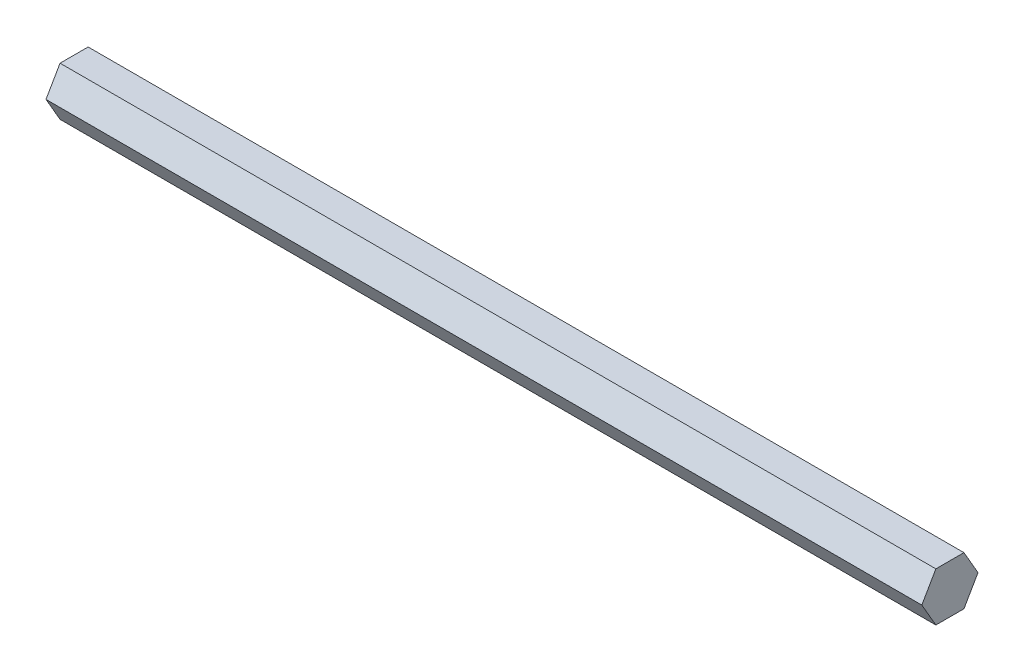
ISO-10303-21;
HEADER;
FILE_DESCRIPTION(('STEP AP214'),'2;1');
FILE_NAME('part.step','',(''),(''),'','','');
FILE_SCHEMA(('AUTOMOTIVE_DESIGN { 1 0 10303 214 1 1 1 1 }'));
ENDSEC;
DATA;
#1=APPLICATION_CONTEXT('core data for automotive mechanical design processes');
#2=APPLICATION_PROTOCOL_DEFINITION('international standard','automotive_design',2000,#1);
#3=PRODUCT_CONTEXT('',#1,'mechanical');
#4=PRODUCT('Part','Part','',(#3));
#5=PRODUCT_RELATED_PRODUCT_CATEGORY('part','',(#4));
#6=PRODUCT_DEFINITION_FORMATION('','',#4);
#7=PRODUCT_DEFINITION_CONTEXT('part definition',#1,'design');
#8=PRODUCT_DEFINITION('design','',#6,#7);
#9=PRODUCT_DEFINITION_SHAPE('','',#8);
#10=(LENGTH_UNIT() NAMED_UNIT(*) SI_UNIT(.MILLI.,.METRE.));
#11=(NAMED_UNIT(*) PLANE_ANGLE_UNIT() SI_UNIT($,.RADIAN.));
#12=(NAMED_UNIT(*) SI_UNIT($,.STERADIAN.) SOLID_ANGLE_UNIT());
#13=UNCERTAINTY_MEASURE_WITH_UNIT(LENGTH_MEASURE(1.E-05),#10,'distance_accuracy_value','');
#14=(GEOMETRIC_REPRESENTATION_CONTEXT(3) GLOBAL_UNCERTAINTY_ASSIGNED_CONTEXT((#13)) GLOBAL_UNIT_ASSIGNED_CONTEXT((#10,
#11,#12)) REPRESENTATION_CONTEXT('',''));
#15=CARTESIAN_POINT('',(0.,0.,0.));
#16=DIRECTION('',(0.,0.,1.));
#17=DIRECTION('',(1.,0.,0.));
#18=AXIS2_PLACEMENT_3D('',#15,#16,#17);
#19=CARTESIAN_POINT('',(228.6,0.,7.33234841870825));
#20=DIRECTION('',(0.,0.5,0.866025403784438));
#21=DIRECTION('',(0.,-0.866025403784439,0.5));
#22=AXIS2_PLACEMENT_3D('',#19,#20,#21);
#23=PLANE('',#22);
#24=DIRECTION('',(0.,0.866025403784438,-0.5));
#25=VECTOR('',#24,1.);
#26=CARTESIAN_POINT('',(0.,0.,7.33234841870825));
#27=LINE('',#26,#25);
#28=CARTESIAN_POINT('',(0.,0.,7.33234841870825));
#29=VERTEX_POINT('',#28);
#30=CARTESIAN_POINT('',(0.,6.35,3.66617420935412));
#31=VERTEX_POINT('',#30);
#32=EDGE_CURVE('E122',#29,#31,#27,.T.);
#33=ORIENTED_EDGE('',*,*,#32,.F.);
#34=DIRECTION('',(-1.,0.,0.));
#35=VECTOR('',#34,1.);
#36=CARTESIAN_POINT('',(228.6,0.,7.33234841870825));
#37=LINE('',#36,#35);
#38=CARTESIAN_POINT('',(228.6,0.,7.33234841870825));
#39=VERTEX_POINT('',#38);
#40=EDGE_CURVE('E11',#39,#29,#37,.T.);
#41=ORIENTED_EDGE('',*,*,#40,.F.);
#42=DIRECTION('',(0.,0.866025403784438,-0.5));
#43=VECTOR('',#42,1.);
#44=CARTESIAN_POINT('',(228.6,0.,7.33234841870825));
#45=LINE('',#44,#43);
#46=CARTESIAN_POINT('',(228.6,6.35,3.66617420935412));
#47=VERTEX_POINT('',#46);
#48=EDGE_CURVE('E138',#39,#47,#45,.T.);
#49=ORIENTED_EDGE('',*,*,#48,.T.);
#50=DIRECTION('',(-1.,0.,0.));
#51=VECTOR('',#50,1.);
#52=CARTESIAN_POINT('',(228.6,6.35,3.66617420935412));
#53=LINE('',#52,#51);
#54=EDGE_CURVE('E45',#47,#31,#53,.T.);
#55=ORIENTED_EDGE('',*,*,#54,.T.);
#56=EDGE_LOOP('',(#33,#41,#49,#55));
#57=FACE_BOUND('',#56,.T.);
#58=ADVANCED_FACE('F39',(#57),#23,.T.);
#59=CARTESIAN_POINT('',(228.6,-6.35,3.66617420935412));
#60=DIRECTION('',(0.,-0.5,0.866025403784439));
#61=DIRECTION('',(0.,-0.866025403784439,-0.5));
#62=AXIS2_PLACEMENT_3D('',#59,#60,#61);
#63=PLANE('',#62);
#64=DIRECTION('',(0.,0.866025403784439,0.5));
#65=VECTOR('',#64,1.);
#66=CARTESIAN_POINT('',(0.,-6.35,3.66617420935412));
#67=LINE('',#66,#65);
#68=CARTESIAN_POINT('',(0.,-6.35,3.66617420935412));
#69=VERTEX_POINT('',#68);
#70=EDGE_CURVE('E136',#69,#29,#67,.T.);
#71=ORIENTED_EDGE('',*,*,#70,.F.);
#72=DIRECTION('',(-1.,0.,0.));
#73=VECTOR('',#72,1.);
#74=CARTESIAN_POINT('',(228.6,-6.35,3.66617420935412));
#75=LINE('',#74,#73);
#76=CARTESIAN_POINT('',(228.6,-6.35,3.66617420935412));
#77=VERTEX_POINT('',#76);
#78=EDGE_CURVE('E48',#77,#69,#75,.T.);
#79=ORIENTED_EDGE('',*,*,#78,.F.);
#80=DIRECTION('',(0.,0.866025403784439,0.5));
#81=VECTOR('',#80,1.);
#82=CARTESIAN_POINT('',(228.6,-6.35,3.66617420935412));
#83=LINE('',#82,#81);
#84=EDGE_CURVE('E111',#77,#39,#83,.T.);
#85=ORIENTED_EDGE('',*,*,#84,.T.);
#86=ORIENTED_EDGE('',*,*,#40,.T.);
#87=EDGE_LOOP('',(#71,#79,#85,#86));
#88=FACE_BOUND('',#87,.T.);
#89=ADVANCED_FACE('F148',(#88),#63,.T.);
#90=CARTESIAN_POINT('',(228.6,-6.35,-3.66617420935413));
#91=DIRECTION('',(0.,-1.,0.));
#92=DIRECTION('',(0.,0.,-1.));
#93=AXIS2_PLACEMENT_3D('',#90,#91,#92);
#94=PLANE('',#93);
#95=DIRECTION('',(0.,0.,1.));
#96=VECTOR('',#95,1.);
#97=CARTESIAN_POINT('',(0.,-6.35,-3.66617420935413));
#98=LINE('',#97,#96);
#99=CARTESIAN_POINT('',(0.,-6.35,-3.66617420935413));
#100=VERTEX_POINT('',#99);
#101=EDGE_CURVE('E101',#100,#69,#98,.T.);
#102=ORIENTED_EDGE('',*,*,#101,.F.);
#103=DIRECTION('',(-1.,0.,0.));
#104=VECTOR('',#103,1.);
#105=CARTESIAN_POINT('',(228.6,-6.35,-3.66617420935413));
#106=LINE('',#105,#104);
#107=CARTESIAN_POINT('',(228.6,-6.35,-3.66617420935413));
#108=VERTEX_POINT('',#107);
#109=EDGE_CURVE('E96',#108,#100,#106,.T.);
#110=ORIENTED_EDGE('',*,*,#109,.F.);
#111=DIRECTION('',(0.,0.,1.));
#112=VECTOR('',#111,1.);
#113=CARTESIAN_POINT('',(228.6,-6.35,-3.66617420935413));
#114=LINE('',#113,#112);
#115=EDGE_CURVE('E97',#108,#77,#114,.T.);
#116=ORIENTED_EDGE('',*,*,#115,.T.);
#117=ORIENTED_EDGE('',*,*,#78,.T.);
#118=EDGE_LOOP('',(#102,#110,#116,#117));
#119=FACE_BOUND('',#118,.T.);
#120=ADVANCED_FACE('F98',(#119),#94,.T.);
#121=CARTESIAN_POINT('',(228.6,0.,-7.33234841870825));
#122=DIRECTION('',(0.,-0.5,-0.866025403784439));
#123=DIRECTION('',(0.,0.866025403784439,-0.5));
#124=AXIS2_PLACEMENT_3D('',#121,#122,#123);
#125=PLANE('',#124);
#126=DIRECTION('',(0.,-0.866025403784439,0.5));
#127=VECTOR('',#126,1.);
#128=CARTESIAN_POINT('',(0.,0.,-7.33234841870825));
#129=LINE('',#128,#127);
#130=CARTESIAN_POINT('',(0.,0.,-7.33234841870825));
#131=VERTEX_POINT('',#130);
#132=EDGE_CURVE('E135',#131,#100,#129,.T.);
#133=ORIENTED_EDGE('',*,*,#132,.F.);
#134=DIRECTION('',(-1.,0.,0.));
#135=VECTOR('',#134,1.);
#136=CARTESIAN_POINT('',(228.6,0.,-7.33234841870825));
#137=LINE('',#136,#135);
#138=CARTESIAN_POINT('',(228.6,0.,-7.33234841870825));
#139=VERTEX_POINT('',#138);
#140=EDGE_CURVE('E106',#139,#131,#137,.T.);
#141=ORIENTED_EDGE('',*,*,#140,.F.);
#142=DIRECTION('',(0.,-0.866025403784439,0.5));
#143=VECTOR('',#142,1.);
#144=CARTESIAN_POINT('',(228.6,0.,-7.33234841870825));
#145=LINE('',#144,#143);
#146=EDGE_CURVE('E115',#139,#108,#145,.T.);
#147=ORIENTED_EDGE('',*,*,#146,.T.);
#148=ORIENTED_EDGE('',*,*,#109,.T.);
#149=EDGE_LOOP('',(#133,#141,#147,#148));
#150=FACE_BOUND('',#149,.T.);
#151=ADVANCED_FACE('F119',(#150),#125,.T.);
#152=CARTESIAN_POINT('',(228.6,6.35,-3.66617420935413));
#153=DIRECTION('',(0.,0.5,-0.866025403784439));
#154=DIRECTION('',(0.,0.866025403784439,0.5));
#155=AXIS2_PLACEMENT_3D('',#152,#153,#154);
#156=PLANE('',#155);
#157=DIRECTION('',(0.,-0.866025403784439,-0.5));
#158=VECTOR('',#157,1.);
#159=CARTESIAN_POINT('',(0.,6.35,-3.66617420935413));
#160=LINE('',#159,#158);
#161=CARTESIAN_POINT('',(0.,6.35,-3.66617420935413));
#162=VERTEX_POINT('',#161);
#163=EDGE_CURVE('E128',#162,#131,#160,.T.);
#164=ORIENTED_EDGE('',*,*,#163,.F.);
#165=DIRECTION('',(-1.,0.,0.));
#166=VECTOR('',#165,1.);
#167=CARTESIAN_POINT('',(228.6,6.35,-3.66617420935413));
#168=LINE('',#167,#166);
#169=CARTESIAN_POINT('',(228.6,6.35,-3.66617420935413));
#170=VERTEX_POINT('',#169);
#171=EDGE_CURVE('E143',#170,#162,#168,.T.);
#172=ORIENTED_EDGE('',*,*,#171,.F.);
#173=DIRECTION('',(0.,-0.866025403784439,-0.5));
#174=VECTOR('',#173,1.);
#175=CARTESIAN_POINT('',(228.6,6.35,-3.66617420935413));
#176=LINE('',#175,#174);
#177=EDGE_CURVE('E116',#170,#139,#176,.T.);
#178=ORIENTED_EDGE('',*,*,#177,.T.);
#179=ORIENTED_EDGE('',*,*,#140,.T.);
#180=EDGE_LOOP('',(#164,#172,#178,#179));
#181=FACE_BOUND('',#180,.T.);
#182=ADVANCED_FACE('F157',(#181),#156,.T.);
#183=CARTESIAN_POINT('',(228.6,6.35,3.66617420935412));
#184=DIRECTION('',(0.,1.,0.));
#185=DIRECTION('',(0.,0.,1.));
#186=AXIS2_PLACEMENT_3D('',#183,#184,#185);
#187=PLANE('',#186);
#188=DIRECTION('',(0.,0.,-1.));
#189=VECTOR('',#188,1.);
#190=CARTESIAN_POINT('',(0.,6.35,3.66617420935412));
#191=LINE('',#190,#189);
#192=EDGE_CURVE('E130',#31,#162,#191,.T.);
#193=ORIENTED_EDGE('',*,*,#192,.F.);
#194=ORIENTED_EDGE('',*,*,#54,.F.);
#195=DIRECTION('',(0.,0.,-1.));
#196=VECTOR('',#195,1.);
#197=CARTESIAN_POINT('',(228.6,6.35,3.66617420935412));
#198=LINE('',#197,#196);
#199=EDGE_CURVE('E118',#47,#170,#198,.T.);
#200=ORIENTED_EDGE('',*,*,#199,.T.);
#201=ORIENTED_EDGE('',*,*,#171,.T.);
#202=EDGE_LOOP('',(#193,#194,#200,#201));
#203=FACE_BOUND('',#202,.T.);
#204=ADVANCED_FACE('F141',(#203),#187,.T.);
#205=CARTESIAN_POINT('',(228.6,0.,0.));
#206=DIRECTION('',(-1.,0.,0.));
#207=DIRECTION('',(0.,0.,1.));
#208=AXIS2_PLACEMENT_3D('',#205,#206,#207);
#209=PLANE('',#208);
#210=ORIENTED_EDGE('',*,*,#48,.F.);
#211=ORIENTED_EDGE('',*,*,#84,.F.);
#212=ORIENTED_EDGE('',*,*,#115,.F.);
#213=ORIENTED_EDGE('',*,*,#146,.F.);
#214=ORIENTED_EDGE('',*,*,#177,.F.);
#215=ORIENTED_EDGE('',*,*,#199,.F.);
#216=EDGE_LOOP('',(#210,#211,#212,#213,#214,#215));
#217=FACE_BOUND('',#216,.T.);
#218=ADVANCED_FACE('F109',(#217),#209,.F.);
#219=CARTESIAN_POINT('',(0.,0.,0.));
#220=DIRECTION('',(-1.,0.,0.));
#221=DIRECTION('',(0.,0.,1.));
#222=AXIS2_PLACEMENT_3D('',#219,#220,#221);
#223=PLANE('',#222);
#224=ORIENTED_EDGE('',*,*,#32,.T.);
#225=ORIENTED_EDGE('',*,*,#192,.T.);
#226=ORIENTED_EDGE('',*,*,#163,.T.);
#227=ORIENTED_EDGE('',*,*,#132,.T.);
#228=ORIENTED_EDGE('',*,*,#101,.T.);
#229=ORIENTED_EDGE('',*,*,#70,.T.);
#230=EDGE_LOOP('',(#224,#225,#226,#227,#228,#229));
#231=FACE_BOUND('',#230,.T.);
#232=ADVANCED_FACE('F144',(#231),#223,.T.);
#233=CLOSED_SHELL('',(#58,#89,#120,#151,#182,#204,#218,#232));
#234=MANIFOLD_SOLID_BREP('B2',#233);
#235=ADVANCED_BREP_SHAPE_REPRESENTATION('',(#18,#234),#14);
#236=SHAPE_DEFINITION_REPRESENTATION(#9,#235);
ENDSEC;
END-ISO-10303-21;
